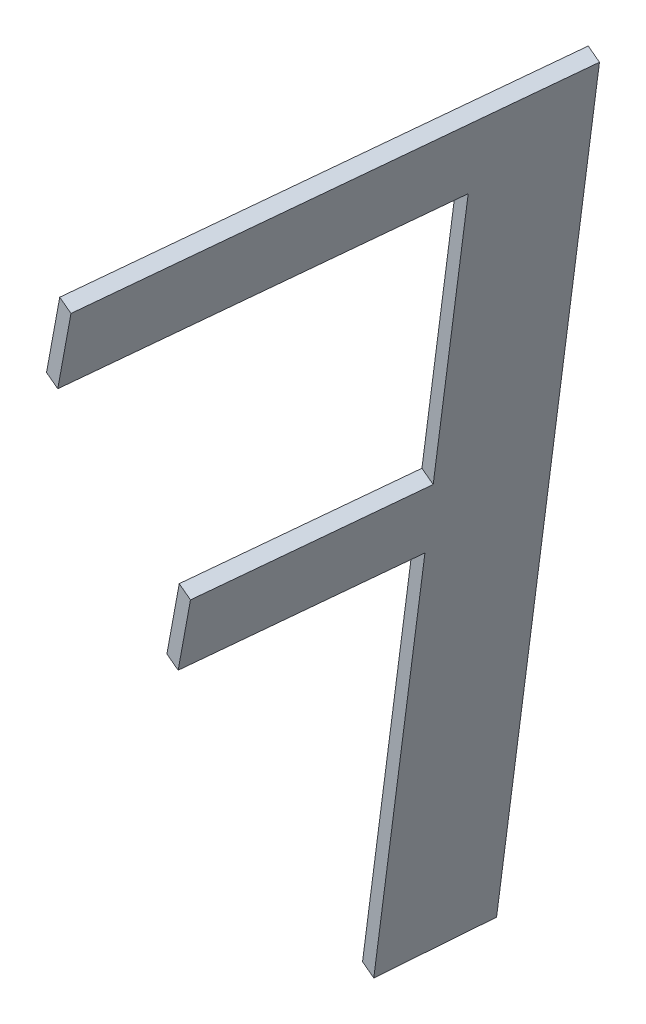
ISO-10303-21;
HEADER;
FILE_DESCRIPTION(('STEP AP214'),'2;1');
FILE_NAME('part.step','',(''),(''),'','','');
FILE_SCHEMA(('AUTOMOTIVE_DESIGN { 1 0 10303 214 1 1 1 1 }'));
ENDSEC;
DATA;
#1=APPLICATION_CONTEXT('core data for automotive mechanical design processes');
#2=APPLICATION_PROTOCOL_DEFINITION('international standard','automotive_design',2000,#1);
#3=PRODUCT_CONTEXT('',#1,'mechanical');
#4=PRODUCT('Part','Part','',(#3));
#5=PRODUCT_RELATED_PRODUCT_CATEGORY('part','',(#4));
#6=PRODUCT_DEFINITION_FORMATION('','',#4);
#7=PRODUCT_DEFINITION_CONTEXT('part definition',#1,'design');
#8=PRODUCT_DEFINITION('design','',#6,#7);
#9=PRODUCT_DEFINITION_SHAPE('','',#8);
#10=(LENGTH_UNIT() NAMED_UNIT(*) SI_UNIT(.MILLI.,.METRE.));
#11=(NAMED_UNIT(*) PLANE_ANGLE_UNIT() SI_UNIT($,.RADIAN.));
#12=(NAMED_UNIT(*) SI_UNIT($,.STERADIAN.) SOLID_ANGLE_UNIT());
#13=UNCERTAINTY_MEASURE_WITH_UNIT(LENGTH_MEASURE(1.E-05),#10,'distance_accuracy_value','');
#14=(GEOMETRIC_REPRESENTATION_CONTEXT(3) GLOBAL_UNCERTAINTY_ASSIGNED_CONTEXT((#13)) GLOBAL_UNIT_ASSIGNED_CONTEXT((#10,
#11,#12)) REPRESENTATION_CONTEXT('',''));
#15=CARTESIAN_POINT('',(0.,0.,0.));
#16=DIRECTION('',(0.,0.,1.));
#17=DIRECTION('',(1.,0.,0.));
#18=AXIS2_PLACEMENT_3D('',#15,#16,#17);
#19=CARTESIAN_POINT('',(-140.445584564047,70.6188438214443,-138.23857830033));
#20=DIRECTION('',(0.251094526540656,0.16569123548096,-0.953676021102616));
#21=DIRECTION('',(0.332083365652077,0.91069878724547,0.245659026227043));
#22=AXIS2_PLACEMENT_3D('',#19,#20,#21);
#23=PLANE('',#22);
#24=DIRECTION('',(-0.909215143405846,0.378383579710355,-0.173648177666983));
#25=VECTOR('',#24,1.);
#26=CARTESIAN_POINT('',(-140.459222791198,70.62451957514,-138.241183022995));
#27=LINE('',#26,#25);
#28=CARTESIAN_POINT('',(-140.445584564047,70.6188438214443,-138.23857830033));
#29=VERTEX_POINT('',#28);
#30=CARTESIAN_POINT('',(-140.472861018349,70.6301953288357,-138.24378774566));
#31=VERTEX_POINT('',#30);
#32=EDGE_CURVE('E35',#29,#31,#27,.T.);
#33=ORIENTED_EDGE('',*,*,#32,.F.);
#34=DIRECTION('',(-0.332083365652076,-0.91069878724547,-0.245659026227044));
#35=VECTOR('',#34,1.);
#36=CARTESIAN_POINT('',(-140.833545296318,69.5549080603703,-138.525572668474));
#37=LINE('',#36,#35);
#38=CARTESIAN_POINT('',(-141.221506028594,68.4909722992881,-138.812567036615));
#39=VERTEX_POINT('',#38);
#40=EDGE_CURVE('E11',#29,#39,#37,.T.);
#41=ORIENTED_EDGE('',*,*,#40,.T.);
#42=DIRECTION('',(-0.909215143405846,0.378383579710355,-0.173648177666983));
#43=VECTOR('',#42,1.);
#44=CARTESIAN_POINT('',(-141.235144255745,68.4966480529837,-138.81517175928));
#45=LINE('',#44,#43);
#46=CARTESIAN_POINT('',(-141.248782482896,68.5023238066794,-138.817776481945));
#47=VERTEX_POINT('',#46);
#48=EDGE_CURVE('E27',#39,#47,#45,.T.);
#49=ORIENTED_EDGE('',*,*,#48,.T.);
#50=DIRECTION('',(-0.332083365652076,-0.91069878724547,-0.245659026227044));
#51=VECTOR('',#50,1.);
#52=CARTESIAN_POINT('',(-140.86082175062,69.5662595677616,-138.530782113804));
#53=LINE('',#52,#51);
#54=EDGE_CURVE('E111',#31,#47,#53,.T.);
#55=ORIENTED_EDGE('',*,*,#54,.F.);
#56=EDGE_LOOP('',(#33,#41,#49,#55));
#57=FACE_BOUND('',#56,.T.);
#58=ADVANCED_FACE('F17',(#57),#23,.T.);
#59=CARTESIAN_POINT('',(-141.221506028594,68.4909722992881,-138.812567036615));
#60=DIRECTION('',(-0.332083365652076,-0.91069878724547,-0.245659026227044));
#61=DIRECTION('',(0.251094526540656,0.165691235480961,-0.953676021102616));
#62=AXIS2_PLACEMENT_3D('',#59,#60,#61);
#63=PLANE('',#62);
#64=ORIENTED_EDGE('',*,*,#48,.F.);
#65=DIRECTION('',(-0.251094526540656,-0.16569123548096,0.953676021102616));
#66=VECTOR('',#65,1.);
#67=CARTESIAN_POINT('',(-141.246615481247,68.4744031757092,-138.717199434574));
#68=LINE('',#67,#66);
#69=CARTESIAN_POINT('',(-141.271724933904,68.457834052167,-138.621831832439));
#70=VERTEX_POINT('',#69);
#71=EDGE_CURVE('E117',#39,#70,#68,.T.);
#72=ORIENTED_EDGE('',*,*,#71,.T.);
#73=DIRECTION('',(-0.909215143405846,0.378383579710355,-0.173648177666983));
#74=VECTOR('',#73,1.);
#75=CARTESIAN_POINT('',(-141.285363161055,68.4635098058627,-138.624436555104));
#76=LINE('',#75,#74);
#77=CARTESIAN_POINT('',(-141.299001388206,68.4691855595583,-138.627041277769));
#78=VERTEX_POINT('',#77);
#79=EDGE_CURVE('E121',#70,#78,#76,.T.);
#80=ORIENTED_EDGE('',*,*,#79,.T.);
#81=DIRECTION('',(-0.251094526540656,-0.16569123548096,0.953676021102616));
#82=VECTOR('',#81,1.);
#83=CARTESIAN_POINT('',(-141.27389193555,68.4857546831006,-138.722408879904));
#84=LINE('',#83,#82);
#85=EDGE_CURVE('E113',#47,#78,#84,.T.);
#86=ORIENTED_EDGE('',*,*,#85,.F.);
#87=EDGE_LOOP('',(#64,#72,#80,#86));
#88=FACE_BOUND('',#87,.T.);
#89=ADVANCED_FACE('F181',(#88),#63,.T.);
#90=CARTESIAN_POINT('',(-140.885923468115,69.5158482840063,-138.336434783932));
#91=DIRECTION('',(0.251094526540656,0.16569123548096,-0.953676021102616));
#92=DIRECTION('',(0.332083365652077,0.91069878724547,0.245659026227043));
#93=AXIS2_PLACEMENT_3D('',#90,#91,#92);
#94=PLANE('',#93);
#95=ORIENTED_EDGE('',*,*,#79,.F.);
#96=DIRECTION('',(0.332083365652076,0.91069878724547,0.245659026227044));
#97=VECTOR('',#96,1.);
#98=CARTESIAN_POINT('',(-141.078824201007,68.9868411680907,-138.479133308188));
#99=LINE('',#98,#97);
#100=CARTESIAN_POINT('',(-140.885923468115,69.5158482840063,-138.336434783932));
#101=VERTEX_POINT('',#100);
#102=EDGE_CURVE('E124',#70,#101,#99,.T.);
#103=ORIENTED_EDGE('',*,*,#102,.T.);
#104=DIRECTION('',(-0.909215143405846,0.378383579710355,-0.173648177666983));
#105=VECTOR('',#104,1.);
#106=CARTESIAN_POINT('',(-140.899561695266,69.5215240377019,-138.339039506597));
#107=LINE('',#106,#105);
#108=CARTESIAN_POINT('',(-140.913199922417,69.5271997913976,-138.341644229262));
#109=VERTEX_POINT('',#108);
#110=EDGE_CURVE('E129',#101,#109,#107,.T.);
#111=ORIENTED_EDGE('',*,*,#110,.T.);
#112=DIRECTION('',(0.332083365652076,0.91069878724547,0.245659026227044));
#113=VECTOR('',#112,1.);
#114=CARTESIAN_POINT('',(-141.106100655309,68.998192675482,-138.484342753518));
#115=LINE('',#114,#113);
#116=EDGE_CURVE('E126',#78,#109,#115,.T.);
#117=ORIENTED_EDGE('',*,*,#116,.F.);
#118=EDGE_LOOP('',(#95,#103,#111,#117));
#119=FACE_BOUND('',#118,.T.);
#120=ADVANCED_FACE('F185',(#119),#94,.F.);
#121=CARTESIAN_POINT('',(-140.521979266488,69.7182576012787,-139.800977751528));
#122=DIRECTION('',(-0.340871517667753,-0.916053339166555,-0.211312300268316));
#123=DIRECTION('',(0.239028097604382,0.132936625530292,-0.96186975321415));
#124=AXIS2_PLACEMENT_3D('',#121,#122,#123);
#125=PLANE('',#124);
#126=ORIENTED_EDGE('',*,*,#110,.F.);
#127=DIRECTION('',(-0.239028097604382,-0.132936625530292,0.96186975321415));
#128=VECTOR('',#127,1.);
#129=CARTESIAN_POINT('',(-140.934124256675,69.489041183751,-138.142470638851));
#130=LINE('',#129,#128);
#131=CARTESIAN_POINT('',(-140.98232504524,69.4622340834428,-137.948506493855));
#132=VERTEX_POINT('',#131);
#133=EDGE_CURVE('E132',#101,#132,#130,.T.);
#134=ORIENTED_EDGE('',*,*,#133,.T.);
#135=DIRECTION('',(-0.909215143405846,0.378383579710355,-0.173648177666983));
#136=VECTOR('',#135,1.);
#137=CARTESIAN_POINT('',(-140.995963272391,69.4679098371385,-137.95111121652));
#138=LINE('',#137,#136);
#139=CARTESIAN_POINT('',(-141.009601499542,69.4735855908341,-137.953715939185));
#140=VERTEX_POINT('',#139);
#141=EDGE_CURVE('E137',#132,#140,#138,.T.);
#142=ORIENTED_EDGE('',*,*,#141,.T.);
#143=DIRECTION('',(-0.239028097604382,-0.132936625530292,0.96186975321415));
#144=VECTOR('',#143,1.);
#145=CARTESIAN_POINT('',(-140.961400710977,69.5003926911423,-138.147680084181));
#146=LINE('',#145,#144);
#147=EDGE_CURVE('E134',#109,#140,#146,.T.);
#148=ORIENTED_EDGE('',*,*,#147,.F.);
#149=EDGE_LOOP('',(#126,#134,#142,#148));
#150=FACE_BOUND('',#149,.T.);
#151=ADVANCED_FACE('F188',(#150),#125,.T.);
#152=CARTESIAN_POINT('',(-140.98232504524,69.4622340834428,-137.948506493855));
#153=DIRECTION('',(-0.239028097604382,-0.132936625530292,0.96186975321415));
#154=DIRECTION('',(-0.340871517667753,-0.916053339166555,-0.211312300268316));
#155=AXIS2_PLACEMENT_3D('',#152,#153,#154);
#156=PLANE('',#155);
#157=ORIENTED_EDGE('',*,*,#141,.F.);
#158=DIRECTION('',(0.340871517667753,0.916053339166555,0.211312300268316));
#159=VECTOR('',#158,1.);
#160=CARTESIAN_POINT('',(-140.950485217732,69.5477999896412,-137.928768420002));
#161=LINE('',#160,#159);
#162=CARTESIAN_POINT('',(-140.918645390229,69.6333658958315,-137.909030346144));
#163=VERTEX_POINT('',#162);
#164=EDGE_CURVE('E140',#132,#163,#161,.T.);
#165=ORIENTED_EDGE('',*,*,#164,.T.);
#166=DIRECTION('',(-0.909215143405846,0.378383579710355,-0.173648177666983));
#167=VECTOR('',#166,1.);
#168=CARTESIAN_POINT('',(-140.93228361738,69.6390416495271,-137.911635068809));
#169=LINE('',#168,#167);
#170=CARTESIAN_POINT('',(-140.945921844531,69.6447174032228,-137.914239791474));
#171=VERTEX_POINT('',#170);
#172=EDGE_CURVE('E145',#163,#171,#169,.T.);
#173=ORIENTED_EDGE('',*,*,#172,.T.);
#174=DIRECTION('',(0.340871517667753,0.916053339166555,0.211312300268316));
#175=VECTOR('',#174,1.);
#176=CARTESIAN_POINT('',(-140.977761672034,69.5591514970325,-137.933977865332));
#177=LINE('',#176,#175);
#178=EDGE_CURVE('E142',#140,#171,#177,.T.);
#179=ORIENTED_EDGE('',*,*,#178,.F.);
#180=EDGE_LOOP('',(#157,#165,#173,#179));
#181=FACE_BOUND('',#180,.T.);
#182=ADVANCED_FACE('F192',(#181),#156,.T.);
#183=CARTESIAN_POINT('',(-140.554701188602,69.8357752131039,-139.37357331374));
#184=DIRECTION('',(0.340871517667753,0.916053339166555,0.211312300268316));
#185=DIRECTION('',(-0.239028097604382,-0.132936625530292,0.96186975321415));
#186=AXIS2_PLACEMENT_3D('',#183,#184,#185);
#187=PLANE('',#186);
#188=ORIENTED_EDGE('',*,*,#172,.F.);
#189=DIRECTION('',(0.239028097604382,0.132936625530292,-0.96186975321415));
#190=VECTOR('',#189,1.);
#191=CARTESIAN_POINT('',(-140.871245525839,69.6597275582926,-138.099771502972));
#192=LINE('',#191,#190);
#193=CARTESIAN_POINT('',(-140.823845661455,69.686089220701,-138.290512659886));
#194=VERTEX_POINT('',#193);
#195=EDGE_CURVE('E148',#163,#194,#192,.T.);
#196=ORIENTED_EDGE('',*,*,#195,.T.);
#197=DIRECTION('',(-0.909215143405846,0.378383579710355,-0.173648177666983));
#198=VECTOR('',#197,1.);
#199=CARTESIAN_POINT('',(-140.837483888606,69.6917649743967,-138.293117382551));
#200=LINE('',#199,#198);
#201=CARTESIAN_POINT('',(-140.851122115758,69.6974407280923,-138.295722105216));
#202=VERTEX_POINT('',#201);
#203=EDGE_CURVE('E153',#194,#202,#200,.T.);
#204=ORIENTED_EDGE('',*,*,#203,.T.);
#205=DIRECTION('',(0.239028097604382,0.132936625530292,-0.96186975321415));
#206=VECTOR('',#205,1.);
#207=CARTESIAN_POINT('',(-140.898521980142,69.671079065684,-138.104980948302));
#208=LINE('',#207,#206);
#209=EDGE_CURVE('E150',#171,#202,#208,.T.);
#210=ORIENTED_EDGE('',*,*,#209,.F.);
#211=EDGE_LOOP('',(#188,#196,#204,#210));
#212=FACE_BOUND('',#211,.T.);
#213=ADVANCED_FACE('F196',(#212),#187,.T.);
#214=CARTESIAN_POINT('',(-140.885923468115,69.5158482840063,-138.336434783932));
#215=DIRECTION('',(0.251094526540656,0.16569123548096,-0.953676021102616));
#216=DIRECTION('',(0.332083365652077,0.91069878724547,0.245659026227043));
#217=AXIS2_PLACEMENT_3D('',#214,#215,#216);
#218=PLANE('',#217);
#219=ORIENTED_EDGE('',*,*,#203,.F.);
#220=DIRECTION('',(0.332083365652076,0.91069878724547,0.245659026227044));
#221=VECTOR('',#220,1.);
#222=CARTESIAN_POINT('',(-140.691862993745,70.0480358517607,-138.192878339718));
#223=LINE('',#222,#221);
#224=CARTESIAN_POINT('',(-140.55988032604,70.4099824827676,-138.095244019636));
#225=VERTEX_POINT('',#224);
#226=EDGE_CURVE('E156',#194,#225,#223,.T.);
#227=ORIENTED_EDGE('',*,*,#226,.T.);
#228=DIRECTION('',(-0.909215143405846,0.378383579710355,-0.173648177666983));
#229=VECTOR('',#228,1.);
#230=CARTESIAN_POINT('',(-140.573518553191,70.4156582364632,-138.097848742301));
#231=LINE('',#230,#229);
#232=CARTESIAN_POINT('',(-140.587156780342,70.4213339901589,-138.100453464966));
#233=VERTEX_POINT('',#232);
#234=EDGE_CURVE('E161',#225,#233,#231,.T.);
#235=ORIENTED_EDGE('',*,*,#234,.T.);
#236=DIRECTION('',(0.332083365652076,0.91069878724547,0.245659026227044));
#237=VECTOR('',#236,1.);
#238=CARTESIAN_POINT('',(-140.719139448047,70.059387359152,-138.198087785048));
#239=LINE('',#238,#237);
#240=EDGE_CURVE('E158',#202,#233,#239,.T.);
#241=ORIENTED_EDGE('',*,*,#240,.F.);
#242=EDGE_LOOP('',(#219,#227,#235,#241));
#243=FACE_BOUND('',#242,.T.);
#244=ADVANCED_FACE('F199',(#243),#218,.F.);
#245=CARTESIAN_POINT('',(-140.195936124411,70.6123918000425,-139.559786987233));
#246=DIRECTION('',(-0.340871517667753,-0.916053339166555,-0.211312300268316));
#247=DIRECTION('',(0.239028097604382,0.132936625530292,-0.96186975321415));
#248=AXIS2_PLACEMENT_3D('',#245,#246,#247);
#249=PLANE('',#248);
#250=ORIENTED_EDGE('',*,*,#234,.F.);
#251=DIRECTION('',(-0.239028097604382,-0.132936625530292,0.96186975321415));
#252=VECTOR('',#251,1.);
#253=CARTESIAN_POINT('',(-140.640034648964,70.3654042707699,-137.772696086615));
#254=LINE('',#253,#252);
#255=CARTESIAN_POINT('',(-140.720188971892,70.3208260587641,-137.450148153589));
#256=VERTEX_POINT('',#255);
#257=EDGE_CURVE('E164',#225,#256,#254,.T.);
#258=ORIENTED_EDGE('',*,*,#257,.T.);
#259=DIRECTION('',(-0.909215143405846,0.378383579710355,-0.173648177666983));
#260=VECTOR('',#259,1.);
#261=CARTESIAN_POINT('',(-140.733827199044,70.3265018124597,-137.452752876254));
#262=LINE('',#261,#260);
#263=CARTESIAN_POINT('',(-140.747465426195,70.3321775661554,-137.455357598919));
#264=VERTEX_POINT('',#263);
#265=EDGE_CURVE('E168',#256,#264,#262,.T.);
#266=ORIENTED_EDGE('',*,*,#265,.T.);
#267=DIRECTION('',(-0.239028097604382,-0.132936625530292,0.96186975321415));
#268=VECTOR('',#267,1.);
#269=CARTESIAN_POINT('',(-140.667311103266,70.3767557781612,-137.777905531945));
#270=LINE('',#269,#268);
#271=EDGE_CURVE('E100',#233,#264,#270,.T.);
#272=ORIENTED_EDGE('',*,*,#271,.F.);
#273=EDGE_LOOP('',(#250,#258,#266,#272));
#274=FACE_BOUND('',#273,.T.);
#275=ADVANCED_FACE('F172',(#274),#249,.T.);
#276=CARTESIAN_POINT('',(-140.652014668362,70.5040367265783,-137.407885693559));
#277=DIRECTION('',(0.239028097604382,0.132936625530292,-0.96186975321415));
#278=DIRECTION('',(0.340871517667753,0.916053339166555,0.211312300268316));
#279=AXIS2_PLACEMENT_3D('',#276,#277,#278);
#280=PLANE('',#279);
#281=ORIENTED_EDGE('',*,*,#265,.F.);
#282=DIRECTION('',(0.340871517667753,0.916053339166555,0.211312300268316));
#283=VECTOR('',#282,1.);
#284=CARTESIAN_POINT('',(-140.686101820129,70.4124313926671,-137.429016923572));
#285=LINE('',#284,#283);
#286=CARTESIAN_POINT('',(-140.652014668362,70.5040367265783,-137.407885693559));
#287=VERTEX_POINT('',#286);
#288=EDGE_CURVE('E106',#256,#287,#285,.T.);
#289=ORIENTED_EDGE('',*,*,#288,.T.);
#290=DIRECTION('',(-0.909215143405846,0.378383579710355,-0.173648177666983));
#291=VECTOR('',#290,1.);
#292=CARTESIAN_POINT('',(-140.665652895513,70.5097124802739,-137.410490416224));
#293=LINE('',#292,#291);
#294=CARTESIAN_POINT('',(-140.679291122665,70.5153882339696,-137.413095138889));
#295=VERTEX_POINT('',#294);
#296=EDGE_CURVE('E92',#287,#295,#293,.T.);
#297=ORIENTED_EDGE('',*,*,#296,.T.);
#298=DIRECTION('',(0.340871517667753,0.916053339166555,0.211312300268316));
#299=VECTOR('',#298,1.);
#300=CARTESIAN_POINT('',(-140.713378274432,70.4237829000584,-137.434226368902));
#301=LINE('',#300,#299);
#302=EDGE_CURVE('E98',#264,#295,#301,.T.);
#303=ORIENTED_EDGE('',*,*,#302,.F.);
#304=EDGE_LOOP('',(#281,#289,#297,#303));
#305=FACE_BOUND('',#304,.T.);
#306=ADVANCED_FACE('F104',(#305),#280,.F.);
#307=CARTESIAN_POINT('',(-140.081640362419,70.8212531387168,-139.703121267925));
#308=DIRECTION('',(-0.340871517667753,-0.916053339166555,-0.211312300268316));
#309=DIRECTION('',(0.239028097604382,0.132936625530292,-0.96186975321415));
#310=AXIS2_PLACEMENT_3D('',#307,#308,#309);
#311=PLANE('',#310);
#312=ORIENTED_EDGE('',*,*,#296,.F.);
#313=DIRECTION('',(0.239028097604382,0.132936625530292,-0.96186975321415));
#314=VECTOR('',#313,1.);
#315=CARTESIAN_POINT('',(-140.548799616202,70.5614402740154,-137.823231996946));
#316=LINE('',#315,#314);
#317=EDGE_CURVE('E108',#287,#29,#316,.T.);
#318=ORIENTED_EDGE('',*,*,#317,.T.);
#319=ORIENTED_EDGE('',*,*,#32,.T.);
#320=DIRECTION('',(0.239028097604382,0.132936625530292,-0.96186975321415));
#321=VECTOR('',#320,1.);
#322=CARTESIAN_POINT('',(-140.576076070505,70.5727917814067,-137.828441442276));
#323=LINE('',#322,#321);
#324=EDGE_CURVE('E21',#295,#31,#323,.T.);
#325=ORIENTED_EDGE('',*,*,#324,.F.);
#326=EDGE_LOOP('',(#312,#318,#319,#325));
#327=FACE_BOUND('',#326,.T.);
#328=ADVANCED_FACE('F110',(#327),#311,.F.);
#329=CARTESIAN_POINT('',(-140.197105636582,63.1845344254721,-155.739144366844));
#330=DIRECTION('',(-0.909215143405846,0.378383579710355,-0.173648177666983));
#331=DIRECTION('',(-0.015180111181639,-0.4469491584612,-0.894430552908015));
#332=AXIS2_PLACEMENT_3D('',#329,#330,#331);
#333=PLANE('',#332);
#334=ORIENTED_EDGE('',*,*,#317,.F.);
#335=ORIENTED_EDGE('',*,*,#288,.F.);
#336=ORIENTED_EDGE('',*,*,#257,.F.);
#337=ORIENTED_EDGE('',*,*,#226,.F.);
#338=ORIENTED_EDGE('',*,*,#195,.F.);
#339=ORIENTED_EDGE('',*,*,#164,.F.);
#340=ORIENTED_EDGE('',*,*,#133,.F.);
#341=ORIENTED_EDGE('',*,*,#102,.F.);
#342=ORIENTED_EDGE('',*,*,#71,.F.);
#343=ORIENTED_EDGE('',*,*,#40,.F.);
#344=EDGE_LOOP('',(#334,#335,#336,#337,#338,#339,#340,#341,#342,#343));
#345=FACE_BOUND('',#344,.T.);
#346=ADVANCED_FACE('F176',(#345),#333,.F.);
#347=CARTESIAN_POINT('',(-140.224382090884,63.1958859328634,-155.744353812174));
#348=DIRECTION('',(-0.909215143405846,0.378383579710355,-0.173648177666983));
#349=DIRECTION('',(-0.015180111181639,-0.4469491584612,-0.894430552908015));
#350=AXIS2_PLACEMENT_3D('',#347,#348,#349);
#351=PLANE('',#350);
#352=ORIENTED_EDGE('',*,*,#54,.T.);
#353=ORIENTED_EDGE('',*,*,#85,.T.);
#354=ORIENTED_EDGE('',*,*,#116,.T.);
#355=ORIENTED_EDGE('',*,*,#147,.T.);
#356=ORIENTED_EDGE('',*,*,#178,.T.);
#357=ORIENTED_EDGE('',*,*,#209,.T.);
#358=ORIENTED_EDGE('',*,*,#240,.T.);
#359=ORIENTED_EDGE('',*,*,#271,.T.);
#360=ORIENTED_EDGE('',*,*,#302,.T.);
#361=ORIENTED_EDGE('',*,*,#324,.T.);
#362=EDGE_LOOP('',(#352,#353,#354,#355,#356,#357,#358,#359,#360,#361));
#363=FACE_BOUND('',#362,.T.);
#364=ADVANCED_FACE('F19',(#363),#351,.T.);
#365=CLOSED_SHELL('',(#58,#89,#120,#151,#182,#213,#244,#275,#306,#328,#346,#364));
#366=MANIFOLD_SOLID_BREP('B1',#365);
#367=ADVANCED_BREP_SHAPE_REPRESENTATION('',(#18,#366),#14);
#368=SHAPE_DEFINITION_REPRESENTATION(#9,#367);
ENDSEC;
END-ISO-10303-21;
